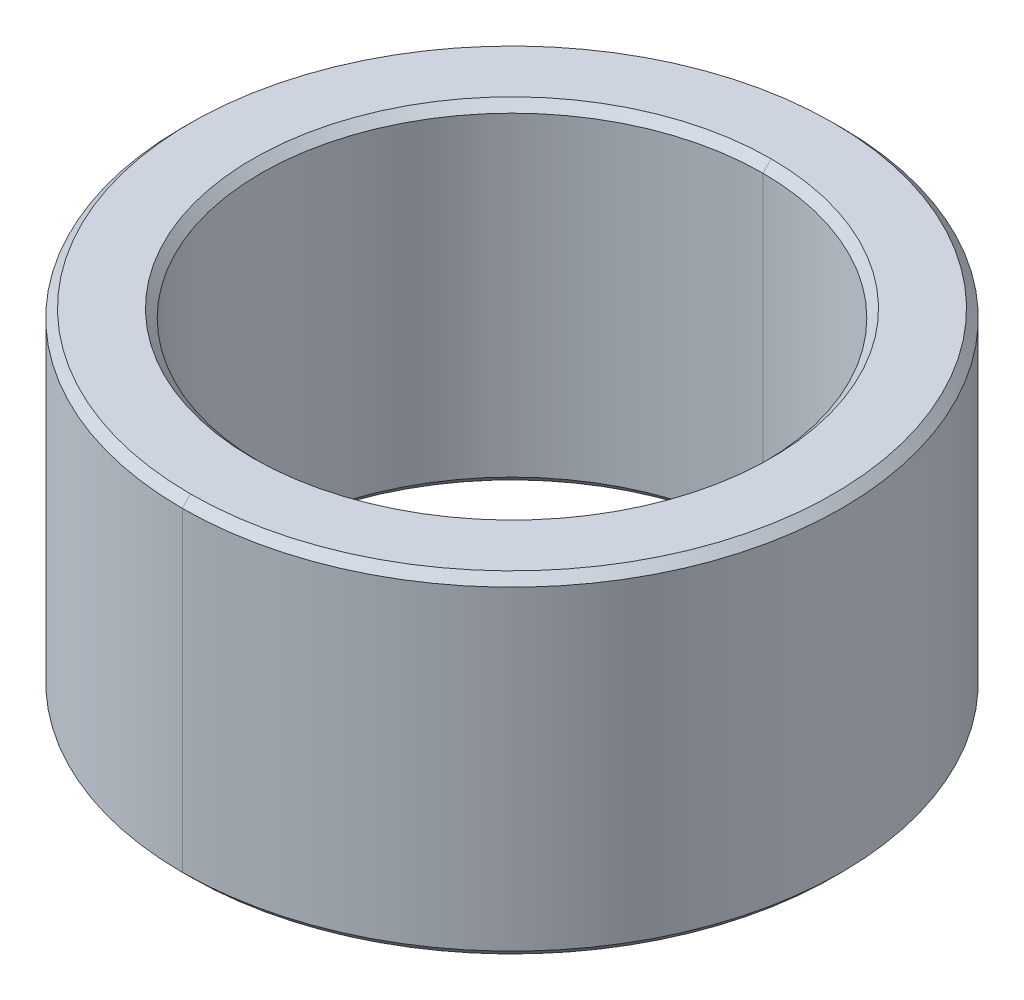
ISO-10303-21;
HEADER;
FILE_DESCRIPTION(('STEP AP214'),'2;1');
FILE_NAME('part.step','',(''),(''),'','','');
FILE_SCHEMA(('AUTOMOTIVE_DESIGN { 1 0 10303 214 1 1 1 1 }'));
ENDSEC;
DATA;
#1=APPLICATION_CONTEXT('core data for automotive mechanical design processes');
#2=APPLICATION_PROTOCOL_DEFINITION('international standard','automotive_design',2000,#1);
#3=PRODUCT_CONTEXT('',#1,'mechanical');
#4=PRODUCT('Part','Part','',(#3));
#5=PRODUCT_RELATED_PRODUCT_CATEGORY('part','',(#4));
#6=PRODUCT_DEFINITION_FORMATION('','',#4);
#7=PRODUCT_DEFINITION_CONTEXT('part definition',#1,'design');
#8=PRODUCT_DEFINITION('design','',#6,#7);
#9=PRODUCT_DEFINITION_SHAPE('','',#8);
#10=(LENGTH_UNIT() NAMED_UNIT(*) SI_UNIT(.MILLI.,.METRE.));
#11=(NAMED_UNIT(*) PLANE_ANGLE_UNIT() SI_UNIT($,.RADIAN.));
#12=(NAMED_UNIT(*) SI_UNIT($,.STERADIAN.) SOLID_ANGLE_UNIT());
#13=UNCERTAINTY_MEASURE_WITH_UNIT(LENGTH_MEASURE(1.E-05),#10,'distance_accuracy_value','');
#14=(GEOMETRIC_REPRESENTATION_CONTEXT(3) GLOBAL_UNCERTAINTY_ASSIGNED_CONTEXT((#13)) GLOBAL_UNIT_ASSIGNED_CONTEXT((#10,
#11,#12)) REPRESENTATION_CONTEXT('',''));
#15=CARTESIAN_POINT('',(0.,0.,0.));
#16=DIRECTION('',(0.,0.,1.));
#17=DIRECTION('',(1.,0.,0.));
#18=AXIS2_PLACEMENT_3D('',#15,#16,#17);
#19=CARTESIAN_POINT('',(0.,1.9,0.));
#20=DIRECTION('',(0.,1.,0.));
#21=DIRECTION('',(0.,0.,1.));
#22=AXIS2_PLACEMENT_3D('',#19,#20,#21);
#23=CONICAL_SURFACE('',#22,3.025,0.785398163397452);
#24=DIRECTION('',(0.,0.707106781186545,-0.707106781186551));
#25=VECTOR('',#24,1.);
#26=CARTESIAN_POINT('',(0.,1.9,-3.025));
#27=LINE('',#26,#25);
#28=CARTESIAN_POINT('',(0.,1.9,-3.025));
#29=VERTEX_POINT('',#28);
#30=CARTESIAN_POINT('',(0.,2.,-3.125));
#31=VERTEX_POINT('',#30);
#32=EDGE_CURVE('E124',#29,#31,#27,.T.);
#33=ORIENTED_EDGE('',*,*,#32,.F.);
#34=CARTESIAN_POINT('',(0.,1.9,0.));
#35=DIRECTION('',(0.,1.,0.));
#36=DIRECTION('',(0.,0.,1.));
#37=AXIS2_PLACEMENT_3D('',#34,#35,#36);
#38=CIRCLE('',#37,3.025);
#39=CARTESIAN_POINT('',(0.,1.9,3.025));
#40=VERTEX_POINT('',#39);
#41=EDGE_CURVE('E29',#40,#29,#38,.T.);
#42=ORIENTED_EDGE('',*,*,#41,.F.);
#43=DIRECTION('',(0.,0.707106781186545,0.707106781186551));
#44=VECTOR('',#43,1.);
#45=CARTESIAN_POINT('',(0.,1.9,3.025));
#46=LINE('',#45,#44);
#47=CARTESIAN_POINT('',(0.,2.,3.125));
#48=VERTEX_POINT('',#47);
#49=EDGE_CURVE('E115',#40,#48,#46,.T.);
#50=ORIENTED_EDGE('',*,*,#49,.T.);
#51=CARTESIAN_POINT('',(0.,2.,0.));
#52=DIRECTION('',(0.,-1.,0.));
#53=DIRECTION('',(0.,0.,1.));
#54=AXIS2_PLACEMENT_3D('',#51,#52,#53);
#55=CIRCLE('',#54,3.125);
#56=EDGE_CURVE('E101',#31,#48,#55,.T.);
#57=ORIENTED_EDGE('',*,*,#56,.F.);
#58=EDGE_LOOP('',(#33,#42,#50,#57));
#59=FACE_BOUND('',#58,.T.);
#60=ADVANCED_FACE('F18',(#59),#23,.F.);
#61=CARTESIAN_POINT('',(0.,-2.,0.));
#62=DIRECTION('',(0.,-1.,0.));
#63=DIRECTION('',(0.,0.,-1.));
#64=AXIS2_PLACEMENT_3D('',#61,#62,#63);
#65=CONICAL_SURFACE('',#64,3.125,0.785398163397438);
#66=DIRECTION('',(0.,-0.707106781186555,0.70710678118654));
#67=VECTOR('',#66,1.);
#68=CARTESIAN_POINT('',(0.,-2.,3.125));
#69=LINE('',#68,#67);
#70=CARTESIAN_POINT('',(0.,-1.9,3.025));
#71=VERTEX_POINT('',#70);
#72=CARTESIAN_POINT('',(0.,-2.,3.125));
#73=VERTEX_POINT('',#72);
#74=EDGE_CURVE('E148',#71,#73,#69,.T.);
#75=ORIENTED_EDGE('',*,*,#74,.F.);
#76=CARTESIAN_POINT('',(0.,-1.9,0.));
#77=DIRECTION('',(0.,-1.,0.));
#78=DIRECTION('',(0.,0.,1.));
#79=AXIS2_PLACEMENT_3D('',#76,#77,#78);
#80=CIRCLE('',#79,3.025);
#81=CARTESIAN_POINT('',(0.,-1.9,-3.025));
#82=VERTEX_POINT('',#81);
#83=EDGE_CURVE('E10',#82,#71,#80,.T.);
#84=ORIENTED_EDGE('',*,*,#83,.F.);
#85=DIRECTION('',(0.,-0.707106781186555,-0.70710678118654));
#86=VECTOR('',#85,1.);
#87=CARTESIAN_POINT('',(0.,-2.,-3.125));
#88=LINE('',#87,#86);
#89=CARTESIAN_POINT('',(0.,-2.,-3.125));
#90=VERTEX_POINT('',#89);
#91=EDGE_CURVE('E180',#82,#90,#88,.T.);
#92=ORIENTED_EDGE('',*,*,#91,.T.);
#93=CARTESIAN_POINT('',(0.,-2.,0.));
#94=DIRECTION('',(0.,1.,0.));
#95=DIRECTION('',(0.,0.,1.));
#96=AXIS2_PLACEMENT_3D('',#93,#94,#95);
#97=CIRCLE('',#96,3.125);
#98=EDGE_CURVE('E147',#73,#90,#97,.T.);
#99=ORIENTED_EDGE('',*,*,#98,.F.);
#100=EDGE_LOOP('',(#75,#84,#92,#99));
#101=FACE_BOUND('',#100,.T.);
#102=ADVANCED_FACE('F257',(#101),#65,.F.);
#103=CARTESIAN_POINT('',(0.,2.,0.));
#104=DIRECTION('',(0.,-1.,0.));
#105=DIRECTION('',(0.,0.,-1.));
#106=AXIS2_PLACEMENT_3D('',#103,#104,#105);
#107=CONICAL_SURFACE('',#106,3.875,0.785398163397448);
#108=DIRECTION('',(0.,-0.707106781186548,0.707106781186548));
#109=VECTOR('',#108,1.);
#110=CARTESIAN_POINT('',(0.,2.,3.875));
#111=LINE('',#110,#109);
#112=CARTESIAN_POINT('',(0.,2.,3.875));
#113=VERTEX_POINT('',#112);
#114=CARTESIAN_POINT('',(0.,1.9,3.975));
#115=VERTEX_POINT('',#114);
#116=EDGE_CURVE('E158',#113,#115,#111,.T.);
#117=ORIENTED_EDGE('',*,*,#116,.F.);
#118=CARTESIAN_POINT('',(0.,2.,0.));
#119=DIRECTION('',(0.,1.,0.));
#120=DIRECTION('',(0.,0.,1.));
#121=AXIS2_PLACEMENT_3D('',#118,#119,#120);
#122=CIRCLE('',#121,3.875);
#123=CARTESIAN_POINT('',(0.,2.,-3.875));
#124=VERTEX_POINT('',#123);
#125=EDGE_CURVE('E112',#124,#113,#122,.T.);
#126=ORIENTED_EDGE('',*,*,#125,.F.);
#127=DIRECTION('',(0.,-0.707106781186548,-0.707106781186548));
#128=VECTOR('',#127,1.);
#129=CARTESIAN_POINT('',(0.,2.,-3.875));
#130=LINE('',#129,#128);
#131=CARTESIAN_POINT('',(0.,1.9,-3.975));
#132=VERTEX_POINT('',#131);
#133=EDGE_CURVE('E157',#124,#132,#130,.T.);
#134=ORIENTED_EDGE('',*,*,#133,.T.);
#135=CARTESIAN_POINT('',(0.,1.9,0.));
#136=DIRECTION('',(0.,-1.,0.));
#137=DIRECTION('',(0.,0.,1.));
#138=AXIS2_PLACEMENT_3D('',#135,#136,#137);
#139=CIRCLE('',#138,3.975);
#140=EDGE_CURVE('E144',#115,#132,#139,.T.);
#141=ORIENTED_EDGE('',*,*,#140,.F.);
#142=EDGE_LOOP('',(#117,#126,#134,#141));
#143=FACE_BOUND('',#142,.T.);
#144=ADVANCED_FACE('F262',(#143),#107,.T.);
#145=CARTESIAN_POINT('',(0.,-1.9,0.));
#146=DIRECTION('',(0.,1.,0.));
#147=DIRECTION('',(0.,0.,1.));
#148=AXIS2_PLACEMENT_3D('',#145,#146,#147);
#149=CONICAL_SURFACE('',#148,3.975,0.785398163397448);
#150=DIRECTION('',(0.,0.707106781186548,-0.707106781186548));
#151=VECTOR('',#150,1.);
#152=CARTESIAN_POINT('',(0.,-1.9,-3.975));
#153=LINE('',#152,#151);
#154=CARTESIAN_POINT('',(0.,-2.,-3.875));
#155=VERTEX_POINT('',#154);
#156=CARTESIAN_POINT('',(0.,-1.9,-3.975));
#157=VERTEX_POINT('',#156);
#158=EDGE_CURVE('E138',#155,#157,#153,.T.);
#159=ORIENTED_EDGE('',*,*,#158,.F.);
#160=CARTESIAN_POINT('',(0.,-2.,0.));
#161=DIRECTION('',(0.,-1.,0.));
#162=DIRECTION('',(0.,0.,1.));
#163=AXIS2_PLACEMENT_3D('',#160,#161,#162);
#164=CIRCLE('',#163,3.875);
#165=CARTESIAN_POINT('',(0.,-2.,3.875));
#166=VERTEX_POINT('',#165);
#167=EDGE_CURVE('E111',#166,#155,#164,.T.);
#168=ORIENTED_EDGE('',*,*,#167,.F.);
#169=DIRECTION('',(0.,0.707106781186548,0.707106781186548));
#170=VECTOR('',#169,1.);
#171=CARTESIAN_POINT('',(0.,-1.9,3.975));
#172=LINE('',#171,#170);
#173=CARTESIAN_POINT('',(0.,-1.9,3.975));
#174=VERTEX_POINT('',#173);
#175=EDGE_CURVE('E162',#166,#174,#172,.T.);
#176=ORIENTED_EDGE('',*,*,#175,.T.);
#177=CARTESIAN_POINT('',(0.,-1.9,0.));
#178=DIRECTION('',(0.,1.,0.));
#179=DIRECTION('',(0.,0.,1.));
#180=AXIS2_PLACEMENT_3D('',#177,#178,#179);
#181=CIRCLE('',#180,3.975);
#182=EDGE_CURVE('E22',#157,#174,#181,.T.);
#183=ORIENTED_EDGE('',*,*,#182,.F.);
#184=EDGE_LOOP('',(#159,#168,#176,#183));
#185=FACE_BOUND('',#184,.T.);
#186=ADVANCED_FACE('F294',(#185),#149,.T.);
#187=CARTESIAN_POINT('',(0.,2.,0.));
#188=DIRECTION('',(0.,-1.,0.));
#189=DIRECTION('',(0.,0.,-1.));
#190=AXIS2_PLACEMENT_3D('',#187,#188,#189);
#191=CYLINDRICAL_SURFACE('',#190,3.025);
#192=DIRECTION('',(0.,-1.,0.));
#193=VECTOR('',#192,1.);
#194=CARTESIAN_POINT('',(0.,2.,3.025));
#195=LINE('',#194,#193);
#196=EDGE_CURVE('E163',#40,#71,#195,.T.);
#197=ORIENTED_EDGE('',*,*,#196,.F.);
#198=ORIENTED_EDGE('',*,*,#41,.T.);
#199=DIRECTION('',(0.,-1.,0.));
#200=VECTOR('',#199,1.);
#201=CARTESIAN_POINT('',(0.,2.,-3.025));
#202=LINE('',#201,#200);
#203=EDGE_CURVE('E167',#29,#82,#202,.T.);
#204=ORIENTED_EDGE('',*,*,#203,.T.);
#205=ORIENTED_EDGE('',*,*,#83,.T.);
#206=EDGE_LOOP('',(#197,#198,#204,#205));
#207=FACE_BOUND('',#206,.T.);
#208=ADVANCED_FACE('F319',(#207),#191,.F.);
#209=CARTESIAN_POINT('',(0.,2.,0.));
#210=DIRECTION('',(0.,-1.,0.));
#211=DIRECTION('',(0.,0.,-1.));
#212=AXIS2_PLACEMENT_3D('',#209,#210,#211);
#213=CYLINDRICAL_SURFACE('',#212,3.975);
#214=DIRECTION('',(0.,-1.,0.));
#215=VECTOR('',#214,1.);
#216=CARTESIAN_POINT('',(0.,2.,3.975));
#217=LINE('',#216,#215);
#218=EDGE_CURVE('E168',#115,#174,#217,.T.);
#219=ORIENTED_EDGE('',*,*,#218,.F.);
#220=ORIENTED_EDGE('',*,*,#140,.T.);
#221=DIRECTION('',(0.,-1.,0.));
#222=VECTOR('',#221,1.);
#223=CARTESIAN_POINT('',(0.,2.,-3.975));
#224=LINE('',#223,#222);
#225=EDGE_CURVE('E171',#132,#157,#224,.T.);
#226=ORIENTED_EDGE('',*,*,#225,.T.);
#227=ORIENTED_EDGE('',*,*,#182,.T.);
#228=EDGE_LOOP('',(#219,#220,#226,#227));
#229=FACE_BOUND('',#228,.T.);
#230=ADVANCED_FACE('F313',(#229),#213,.T.);
#231=CARTESIAN_POINT('',(0.,-2.,0.));
#232=DIRECTION('',(0.,1.,0.));
#233=DIRECTION('',(1.,0.,0.));
#234=AXIS2_PLACEMENT_3D('',#231,#232,#233);
#235=PLANE('',#234);
#236=CARTESIAN_POINT('',(0.,-2.,0.));
#237=DIRECTION('',(0.,1.,0.));
#238=DIRECTION('',(0.,0.,1.));
#239=AXIS2_PLACEMENT_3D('',#236,#237,#238);
#240=CIRCLE('',#239,3.125);
#241=EDGE_CURVE('E152',#90,#73,#240,.T.);
#242=ORIENTED_EDGE('',*,*,#241,.T.);
#243=ORIENTED_EDGE('',*,*,#98,.T.);
#244=EDGE_LOOP('',(#242,#243));
#245=FACE_BOUND('',#244,.T.);
#246=ORIENTED_EDGE('',*,*,#167,.T.);
#247=CARTESIAN_POINT('',(0.,-2.,0.));
#248=DIRECTION('',(0.,-1.,0.));
#249=DIRECTION('',(0.,0.,1.));
#250=AXIS2_PLACEMENT_3D('',#247,#248,#249);
#251=CIRCLE('',#250,3.875);
#252=EDGE_CURVE('E143',#155,#166,#251,.T.);
#253=ORIENTED_EDGE('',*,*,#252,.T.);
#254=EDGE_LOOP('',(#246,#253));
#255=FACE_BOUND('',#254,.T.);
#256=ADVANCED_FACE('F318',(#245,#255),#235,.F.);
#257=CARTESIAN_POINT('',(0.,2.,0.));
#258=DIRECTION('',(0.,1.,0.));
#259=DIRECTION('',(1.,0.,0.));
#260=AXIS2_PLACEMENT_3D('',#257,#258,#259);
#261=PLANE('',#260);
#262=CARTESIAN_POINT('',(0.,2.,0.));
#263=DIRECTION('',(0.,-1.,0.));
#264=DIRECTION('',(0.,0.,1.));
#265=AXIS2_PLACEMENT_3D('',#262,#263,#264);
#266=CIRCLE('',#265,3.125);
#267=EDGE_CURVE('E106',#48,#31,#266,.T.);
#268=ORIENTED_EDGE('',*,*,#267,.T.);
#269=ORIENTED_EDGE('',*,*,#56,.T.);
#270=EDGE_LOOP('',(#268,#269));
#271=FACE_BOUND('',#270,.T.);
#272=ORIENTED_EDGE('',*,*,#125,.T.);
#273=CARTESIAN_POINT('',(0.,2.,0.));
#274=DIRECTION('',(0.,1.,0.));
#275=DIRECTION('',(0.,0.,1.));
#276=AXIS2_PLACEMENT_3D('',#273,#274,#275);
#277=CIRCLE('',#276,3.875);
#278=EDGE_CURVE('E177',#113,#124,#277,.T.);
#279=ORIENTED_EDGE('',*,*,#278,.T.);
#280=EDGE_LOOP('',(#272,#279));
#281=FACE_BOUND('',#280,.T.);
#282=ADVANCED_FACE('F103',(#271,#281),#261,.T.);
#283=CARTESIAN_POINT('',(0.,2.,0.));
#284=DIRECTION('',(0.,-1.,0.));
#285=DIRECTION('',(0.,0.,-1.));
#286=AXIS2_PLACEMENT_3D('',#283,#284,#285);
#287=CYLINDRICAL_SURFACE('',#286,3.975);
#288=CARTESIAN_POINT('',(0.,1.9,0.));
#289=DIRECTION('',(0.,-1.,0.));
#290=DIRECTION('',(0.,0.,1.));
#291=AXIS2_PLACEMENT_3D('',#288,#289,#290);
#292=CIRCLE('',#291,3.975);
#293=EDGE_CURVE('E153',#132,#115,#292,.T.);
#294=ORIENTED_EDGE('',*,*,#293,.T.);
#295=ORIENTED_EDGE('',*,*,#218,.T.);
#296=CARTESIAN_POINT('',(0.,-1.9,0.));
#297=DIRECTION('',(0.,1.,0.));
#298=DIRECTION('',(0.,0.,1.));
#299=AXIS2_PLACEMENT_3D('',#296,#297,#298);
#300=CIRCLE('',#299,3.975);
#301=EDGE_CURVE('E142',#174,#157,#300,.T.);
#302=ORIENTED_EDGE('',*,*,#301,.T.);
#303=ORIENTED_EDGE('',*,*,#225,.F.);
#304=EDGE_LOOP('',(#294,#295,#302,#303));
#305=FACE_BOUND('',#304,.T.);
#306=ADVANCED_FACE('F242',(#305),#287,.T.);
#307=CARTESIAN_POINT('',(0.,2.,0.));
#308=DIRECTION('',(0.,-1.,0.));
#309=DIRECTION('',(0.,0.,-1.));
#310=AXIS2_PLACEMENT_3D('',#307,#308,#309);
#311=CYLINDRICAL_SURFACE('',#310,3.025);
#312=CARTESIAN_POINT('',(0.,1.9,0.));
#313=DIRECTION('',(0.,1.,0.));
#314=DIRECTION('',(0.,0.,1.));
#315=AXIS2_PLACEMENT_3D('',#312,#313,#314);
#316=CIRCLE('',#315,3.025);
#317=EDGE_CURVE('E132',#29,#40,#316,.T.);
#318=ORIENTED_EDGE('',*,*,#317,.T.);
#319=ORIENTED_EDGE('',*,*,#196,.T.);
#320=CARTESIAN_POINT('',(0.,-1.9,0.));
#321=DIRECTION('',(0.,-1.,0.));
#322=DIRECTION('',(0.,0.,1.));
#323=AXIS2_PLACEMENT_3D('',#320,#321,#322);
#324=CIRCLE('',#323,3.025);
#325=EDGE_CURVE('E121',#71,#82,#324,.T.);
#326=ORIENTED_EDGE('',*,*,#325,.T.);
#327=ORIENTED_EDGE('',*,*,#203,.F.);
#328=EDGE_LOOP('',(#318,#319,#326,#327));
#329=FACE_BOUND('',#328,.T.);
#330=ADVANCED_FACE('F247',(#329),#311,.F.);
#331=CARTESIAN_POINT('',(0.,-1.9,0.));
#332=DIRECTION('',(0.,1.,0.));
#333=DIRECTION('',(0.,0.,1.));
#334=AXIS2_PLACEMENT_3D('',#331,#332,#333);
#335=CONICAL_SURFACE('',#334,3.975,0.785398163397448);
#336=ORIENTED_EDGE('',*,*,#252,.F.);
#337=ORIENTED_EDGE('',*,*,#158,.T.);
#338=ORIENTED_EDGE('',*,*,#301,.F.);
#339=ORIENTED_EDGE('',*,*,#175,.F.);
#340=EDGE_LOOP('',(#336,#337,#338,#339));
#341=FACE_BOUND('',#340,.T.);
#342=ADVANCED_FACE('F20',(#341),#335,.T.);
#343=CARTESIAN_POINT('',(0.,2.,0.));
#344=DIRECTION('',(0.,-1.,0.));
#345=DIRECTION('',(0.,0.,-1.));
#346=AXIS2_PLACEMENT_3D('',#343,#344,#345);
#347=CONICAL_SURFACE('',#346,3.875,0.785398163397448);
#348=ORIENTED_EDGE('',*,*,#278,.F.);
#349=ORIENTED_EDGE('',*,*,#116,.T.);
#350=ORIENTED_EDGE('',*,*,#293,.F.);
#351=ORIENTED_EDGE('',*,*,#133,.F.);
#352=EDGE_LOOP('',(#348,#349,#350,#351));
#353=FACE_BOUND('',#352,.T.);
#354=ADVANCED_FACE('F231',(#353),#347,.T.);
#355=CARTESIAN_POINT('',(0.,-2.,0.));
#356=DIRECTION('',(0.,-1.,0.));
#357=DIRECTION('',(0.,0.,-1.));
#358=AXIS2_PLACEMENT_3D('',#355,#356,#357);
#359=CONICAL_SURFACE('',#358,3.125,0.785398163397438);
#360=ORIENTED_EDGE('',*,*,#325,.F.);
#361=ORIENTED_EDGE('',*,*,#74,.T.);
#362=ORIENTED_EDGE('',*,*,#241,.F.);
#363=ORIENTED_EDGE('',*,*,#91,.F.);
#364=EDGE_LOOP('',(#360,#361,#362,#363));
#365=FACE_BOUND('',#364,.T.);
#366=ADVANCED_FACE('F226',(#365),#359,.F.);
#367=CARTESIAN_POINT('',(0.,1.9,0.));
#368=DIRECTION('',(0.,1.,0.));
#369=DIRECTION('',(0.,0.,1.));
#370=AXIS2_PLACEMENT_3D('',#367,#368,#369);
#371=CONICAL_SURFACE('',#370,3.025,0.785398163397452);
#372=ORIENTED_EDGE('',*,*,#317,.F.);
#373=ORIENTED_EDGE('',*,*,#32,.T.);
#374=ORIENTED_EDGE('',*,*,#267,.F.);
#375=ORIENTED_EDGE('',*,*,#49,.F.);
#376=EDGE_LOOP('',(#372,#373,#374,#375));
#377=FACE_BOUND('',#376,.T.);
#378=ADVANCED_FACE('F123',(#377),#371,.F.);
#379=CLOSED_SHELL('',(#60,#102,#144,#186,#208,#230,#256,#282,#306,#330,#342,#354,#366,#378));
#380=MANIFOLD_SOLID_BREP('B1',#379);
#381=ADVANCED_BREP_SHAPE_REPRESENTATION('',(#18,#380),#14);
#382=SHAPE_DEFINITION_REPRESENTATION(#9,#381);
ENDSEC;
END-ISO-10303-21;
